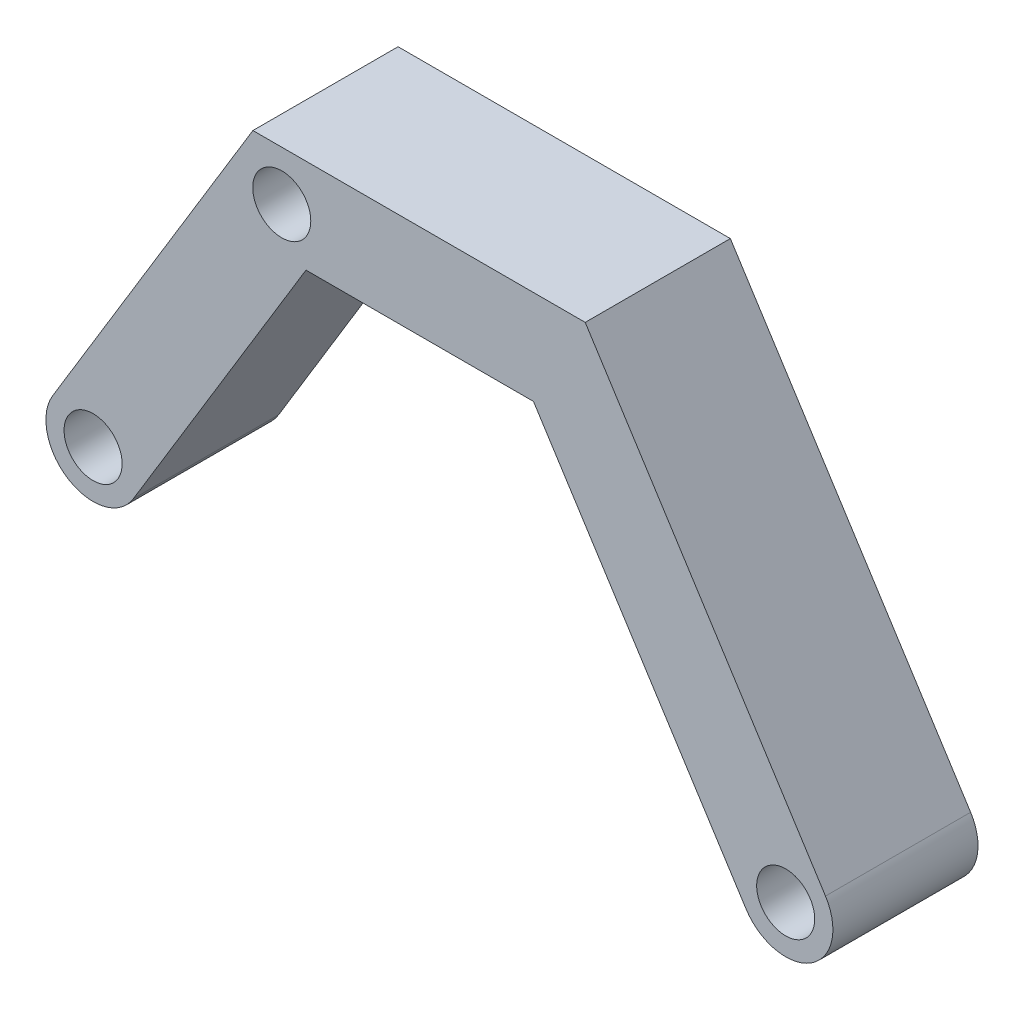
ISO-10303-21;
HEADER;
FILE_DESCRIPTION(('STEP AP214'),'2;1');
FILE_NAME('part.step','',(''),(''),'','','');
FILE_SCHEMA(('AUTOMOTIVE_DESIGN { 1 0 10303 214 1 1 1 1 }'));
ENDSEC;
DATA;
#1=APPLICATION_CONTEXT('core data for automotive mechanical design processes');
#2=APPLICATION_PROTOCOL_DEFINITION('international standard','automotive_design',2000,#1);
#3=PRODUCT_CONTEXT('',#1,'mechanical');
#4=PRODUCT('Part','Part','',(#3));
#5=PRODUCT_RELATED_PRODUCT_CATEGORY('part','',(#4));
#6=PRODUCT_DEFINITION_FORMATION('','',#4);
#7=PRODUCT_DEFINITION_CONTEXT('part definition',#1,'design');
#8=PRODUCT_DEFINITION('design','',#6,#7);
#9=PRODUCT_DEFINITION_SHAPE('','',#8);
#10=(LENGTH_UNIT() NAMED_UNIT(*) SI_UNIT(.MILLI.,.METRE.));
#11=(NAMED_UNIT(*) PLANE_ANGLE_UNIT() SI_UNIT($,.RADIAN.));
#12=(NAMED_UNIT(*) SI_UNIT($,.STERADIAN.) SOLID_ANGLE_UNIT());
#13=UNCERTAINTY_MEASURE_WITH_UNIT(LENGTH_MEASURE(1.E-05),#10,'distance_accuracy_value','');
#14=(GEOMETRIC_REPRESENTATION_CONTEXT(3) GLOBAL_UNCERTAINTY_ASSIGNED_CONTEXT((#13)) GLOBAL_UNIT_ASSIGNED_CONTEXT((#10,
#11,#12)) REPRESENTATION_CONTEXT('',''));
#15=CARTESIAN_POINT('',(0.,0.,0.));
#16=DIRECTION('',(0.,0.,1.));
#17=DIRECTION('',(1.,0.,0.));
#18=AXIS2_PLACEMENT_3D('',#15,#16,#17);
#19=CARTESIAN_POINT('',(14.4513309187229,-15.3639147043616,40.));
#20=DIRECTION('',(0.,0.,1.));
#21=DIRECTION('',(1.,0.,0.));
#22=AXIS2_PLACEMENT_3D('',#19,#20,#21);
#23=PLANE('',#22);
#24=CARTESIAN_POINT('',(66.4465332523392,68.5833959349722,40.));
#25=DIRECTION('',(0.,0.,1.));
#26=DIRECTION('',(1.,0.,0.));
#27=AXIS2_PLACEMENT_3D('',#24,#25,#26);
#28=CIRCLE('',#27,8.00000000000001);
#29=CARTESIAN_POINT('',(74.4465332523392,68.5833959349722,40.));
#30=VERTEX_POINT('',#29);
#31=EDGE_CURVE('E226',#30,#30,#28,.T.);
#32=ORIENTED_EDGE('',*,*,#31,.F.);
#33=EDGE_LOOP('',(#32));
#34=FACE_BOUND('',#33,.T.);
#35=CARTESIAN_POINT('',(14.4513309187229,-15.3639147043616,40.));
#36=DIRECTION('',(0.,0.,1.));
#37=DIRECTION('',(1.,0.,0.));
#38=AXIS2_PLACEMENT_3D('',#35,#36,#37);
#39=CIRCLE('',#38,8.);
#40=CARTESIAN_POINT('',(22.4513309187229,-15.3639147043616,40.));
#41=VERTEX_POINT('',#40);
#42=EDGE_CURVE('E147',#41,#41,#39,.T.);
#43=ORIENTED_EDGE('',*,*,#42,.F.);
#44=EDGE_LOOP('',(#43));
#45=FACE_BOUND('',#44,.T.);
#46=CARTESIAN_POINT('',(14.4513309187229,-15.3639147043616,40.));
#47=DIRECTION('',(0.,0.,1.));
#48=DIRECTION('',(1.,0.,0.));
#49=AXIS2_PLACEMENT_3D('',#46,#47,#48);
#50=CIRCLE('',#49,13.);
#51=CARTESIAN_POINT('',(3.33953923838088,-8.61646439682452,40.));
#52=VERTEX_POINT('',#51);
#53=CARTESIAN_POINT('',(25.5631225990649,-22.1113650118987,40.));
#54=VERTEX_POINT('',#53);
#55=EDGE_CURVE('E165',#52,#54,#50,.T.);
#56=ORIENTED_EDGE('',*,*,#55,.T.);
#57=DIRECTION('',(0.519034639041316,0.854753206180153,0.));
#58=VECTOR('',#57,1.);
#59=CARTESIAN_POINT('',(25.5631225990649,-22.1113650118987,40.));
#60=LINE('',#59,#58);
#61=CARTESIAN_POINT('',(73.1268271993905,56.2171817687676,40.));
#62=VERTEX_POINT('',#61);
#63=EDGE_CURVE('E101',#54,#62,#60,.T.);
#64=ORIENTED_EDGE('',*,*,#63,.T.);
#65=DIRECTION('',(1.,0.,0.));
#66=VECTOR('',#65,1.);
#67=CARTESIAN_POINT('',(73.1268271993905,56.2171817687676,40.));
#68=LINE('',#67,#66);
#69=CARTESIAN_POINT('',(135.819853477294,56.2171817687676,40.));
#70=VERTEX_POINT('',#69);
#71=EDGE_CURVE('E187',#62,#70,#68,.T.);
#72=ORIENTED_EDGE('',*,*,#71,.T.);
#73=DIRECTION('',(0.537781372943536,-0.843084334402535,0.));
#74=VECTOR('',#73,1.);
#75=CARTESIAN_POINT('',(135.819853477294,56.2171817687676,40.));
#76=LINE('',#75,#74);
#77=CARTESIAN_POINT('',(194.374158499835,-35.5788895717599,40.));
#78=VERTEX_POINT('',#77);
#79=EDGE_CURVE('E201',#70,#78,#76,.T.);
#80=ORIENTED_EDGE('',*,*,#79,.T.);
#81=CARTESIAN_POINT('',(205.334254847068,-28.587731723494,40.));
#82=DIRECTION('',(0.,0.,1.));
#83=DIRECTION('',(1.,0.,0.));
#84=AXIS2_PLACEMENT_3D('',#81,#82,#83);
#85=CIRCLE('',#84,13.);
#86=CARTESIAN_POINT('',(216.294351194301,-21.596573875228,40.));
#87=VERTEX_POINT('',#86);
#88=EDGE_CURVE('E120',#78,#87,#85,.T.);
#89=ORIENTED_EDGE('',*,*,#88,.T.);
#90=DIRECTION('',(-0.537781372943536,0.843084334402535,0.));
#91=VECTOR('',#90,1.);
#92=CARTESIAN_POINT('',(150.074280719125,82.2171817687676,40.));
#93=LINE('',#92,#91);
#94=CARTESIAN_POINT('',(150.074280719125,82.2171817687676,40.));
#95=VERTEX_POINT('',#94);
#96=EDGE_CURVE('E114',#87,#95,#93,.T.);
#97=ORIENTED_EDGE('',*,*,#96,.T.);
#98=DIRECTION('',(-1.,0.,0.));
#99=VECTOR('',#98,1.);
#100=CARTESIAN_POINT('',(58.4967570288316,82.2171817687676,40.));
#101=LINE('',#100,#99);
#102=CARTESIAN_POINT('',(58.4967570288316,82.2171817687676,40.));
#103=VERTEX_POINT('',#102);
#104=EDGE_CURVE('E118',#95,#103,#101,.T.);
#105=ORIENTED_EDGE('',*,*,#104,.T.);
#106=DIRECTION('',(-0.519034639041316,-0.854753206180153,0.));
#107=VECTOR('',#106,1.);
#108=CARTESIAN_POINT('',(3.33953923838088,-8.61646439682452,40.));
#109=LINE('',#108,#107);
#110=EDGE_CURVE('E58',#103,#52,#109,.T.);
#111=ORIENTED_EDGE('',*,*,#110,.T.);
#112=EDGE_LOOP('',(#56,#64,#72,#80,#89,#97,#105,#111));
#113=FACE_BOUND('',#112,.T.);
#114=CARTESIAN_POINT('',(205.334254847068,-28.587731723494,40.));
#115=DIRECTION('',(0.,0.,1.));
#116=DIRECTION('',(1.,0.,0.));
#117=AXIS2_PLACEMENT_3D('',#114,#115,#116);
#118=CIRCLE('',#117,8.00000000000001);
#119=CARTESIAN_POINT('',(213.334254847068,-28.587731723494,40.));
#120=VERTEX_POINT('',#119);
#121=EDGE_CURVE('E215',#120,#120,#118,.T.);
#122=ORIENTED_EDGE('',*,*,#121,.F.);
#123=EDGE_LOOP('',(#122));
#124=FACE_BOUND('',#123,.T.);
#125=ADVANCED_FACE('F39',(#34,#45,#113,#124),#23,.T.);
#126=CARTESIAN_POINT('',(14.4513309187229,-15.3639147043616,0.));
#127=DIRECTION('',(0.,0.,1.));
#128=DIRECTION('',(1.,0.,0.));
#129=AXIS2_PLACEMENT_3D('',#126,#127,#128);
#130=PLANE('',#129);
#131=CARTESIAN_POINT('',(66.4465332523392,68.5833959349722,0.));
#132=DIRECTION('',(0.,0.,1.));
#133=DIRECTION('',(1.,0.,0.));
#134=AXIS2_PLACEMENT_3D('',#131,#132,#133);
#135=CIRCLE('',#134,8.00000000000001);
#136=CARTESIAN_POINT('',(74.4465332523392,68.5833959349722,0.));
#137=VERTEX_POINT('',#136);
#138=EDGE_CURVE('E43',#137,#137,#135,.T.);
#139=ORIENTED_EDGE('',*,*,#138,.T.);
#140=EDGE_LOOP('',(#139));
#141=FACE_BOUND('',#140,.T.);
#142=CARTESIAN_POINT('',(14.4513309187229,-15.3639147043616,0.));
#143=DIRECTION('',(0.,0.,1.));
#144=DIRECTION('',(1.,0.,0.));
#145=AXIS2_PLACEMENT_3D('',#142,#143,#144);
#146=CIRCLE('',#145,13.);
#147=CARTESIAN_POINT('',(3.33953923838088,-8.61646439682452,0.));
#148=VERTEX_POINT('',#147);
#149=CARTESIAN_POINT('',(25.5631225990649,-22.1113650118987,0.));
#150=VERTEX_POINT('',#149);
#151=EDGE_CURVE('E142',#148,#150,#146,.T.);
#152=ORIENTED_EDGE('',*,*,#151,.F.);
#153=DIRECTION('',(-0.519034639041316,-0.854753206180153,0.));
#154=VECTOR('',#153,1.);
#155=CARTESIAN_POINT('',(3.33953923838088,-8.61646439682452,0.));
#156=LINE('',#155,#154);
#157=CARTESIAN_POINT('',(58.4967570288316,82.2171817687676,0.));
#158=VERTEX_POINT('',#157);
#159=EDGE_CURVE('E93',#158,#148,#156,.T.);
#160=ORIENTED_EDGE('',*,*,#159,.F.);
#161=DIRECTION('',(-1.,0.,0.));
#162=VECTOR('',#161,1.);
#163=CARTESIAN_POINT('',(58.4967570288316,82.2171817687676,0.));
#164=LINE('',#163,#162);
#165=CARTESIAN_POINT('',(150.074280719125,82.2171817687676,0.));
#166=VERTEX_POINT('',#165);
#167=EDGE_CURVE('E87',#166,#158,#164,.T.);
#168=ORIENTED_EDGE('',*,*,#167,.F.);
#169=DIRECTION('',(-0.537781372943536,0.843084334402535,0.));
#170=VECTOR('',#169,1.);
#171=CARTESIAN_POINT('',(150.074280719125,82.2171817687676,0.));
#172=LINE('',#171,#170);
#173=CARTESIAN_POINT('',(216.294351194301,-21.596573875228,0.));
#174=VERTEX_POINT('',#173);
#175=EDGE_CURVE('E129',#174,#166,#172,.T.);
#176=ORIENTED_EDGE('',*,*,#175,.F.);
#177=CARTESIAN_POINT('',(205.334254847068,-28.587731723494,0.));
#178=DIRECTION('',(0.,0.,1.));
#179=DIRECTION('',(1.,0.,0.));
#180=AXIS2_PLACEMENT_3D('',#177,#178,#179);
#181=CIRCLE('',#180,13.);
#182=CARTESIAN_POINT('',(194.374158499835,-35.5788895717599,0.));
#183=VERTEX_POINT('',#182);
#184=EDGE_CURVE('E156',#183,#174,#181,.T.);
#185=ORIENTED_EDGE('',*,*,#184,.F.);
#186=DIRECTION('',(0.537781372943536,-0.843084334402535,0.));
#187=VECTOR('',#186,1.);
#188=CARTESIAN_POINT('',(135.819853477294,56.2171817687676,0.));
#189=LINE('',#188,#187);
#190=CARTESIAN_POINT('',(135.819853477294,56.2171817687676,0.));
#191=VERTEX_POINT('',#190);
#192=EDGE_CURVE('E153',#191,#183,#189,.T.);
#193=ORIENTED_EDGE('',*,*,#192,.F.);
#194=DIRECTION('',(1.,0.,0.));
#195=VECTOR('',#194,1.);
#196=CARTESIAN_POINT('',(73.1268271993905,56.2171817687676,0.));
#197=LINE('',#196,#195);
#198=CARTESIAN_POINT('',(73.1268271993905,56.2171817687676,0.));
#199=VERTEX_POINT('',#198);
#200=EDGE_CURVE('E150',#199,#191,#197,.T.);
#201=ORIENTED_EDGE('',*,*,#200,.F.);
#202=DIRECTION('',(0.519034639041316,0.854753206180153,0.));
#203=VECTOR('',#202,1.);
#204=CARTESIAN_POINT('',(25.5631225990649,-22.1113650118987,0.));
#205=LINE('',#204,#203);
#206=EDGE_CURVE('E146',#150,#199,#205,.T.);
#207=ORIENTED_EDGE('',*,*,#206,.F.);
#208=EDGE_LOOP('',(#152,#160,#168,#176,#185,#193,#201,#207));
#209=FACE_BOUND('',#208,.T.);
#210=CARTESIAN_POINT('',(14.4513309187229,-15.3639147043616,0.));
#211=DIRECTION('',(0.,0.,1.));
#212=DIRECTION('',(1.,0.,0.));
#213=AXIS2_PLACEMENT_3D('',#210,#211,#212);
#214=CIRCLE('',#213,8.);
#215=CARTESIAN_POINT('',(22.4513309187229,-15.3639147043616,0.));
#216=VERTEX_POINT('',#215);
#217=EDGE_CURVE('E211',#216,#216,#214,.T.);
#218=ORIENTED_EDGE('',*,*,#217,.T.);
#219=EDGE_LOOP('',(#218));
#220=FACE_BOUND('',#219,.T.);
#221=CARTESIAN_POINT('',(205.334254847068,-28.587731723494,0.));
#222=DIRECTION('',(0.,0.,1.));
#223=DIRECTION('',(1.,0.,0.));
#224=AXIS2_PLACEMENT_3D('',#221,#222,#223);
#225=CIRCLE('',#224,8.00000000000001);
#226=CARTESIAN_POINT('',(213.334254847068,-28.587731723494,0.));
#227=VERTEX_POINT('',#226);
#228=EDGE_CURVE('E219',#227,#227,#225,.T.);
#229=ORIENTED_EDGE('',*,*,#228,.T.);
#230=EDGE_LOOP('',(#229));
#231=FACE_BOUND('',#230,.T.);
#232=ADVANCED_FACE('F191',(#141,#209,#220,#231),#130,.F.);
#233=CARTESIAN_POINT('',(14.4513309187229,-15.3639147043616,40.));
#234=DIRECTION('',(0.,0.,-1.));
#235=DIRECTION('',(-1.,0.,0.));
#236=AXIS2_PLACEMENT_3D('',#233,#234,#235);
#237=CYLINDRICAL_SURFACE('',#236,13.);
#238=ORIENTED_EDGE('',*,*,#151,.T.);
#239=DIRECTION('',(0.,0.,-1.));
#240=VECTOR('',#239,1.);
#241=CARTESIAN_POINT('',(25.5631225990649,-22.1113650118987,40.));
#242=LINE('',#241,#240);
#243=EDGE_CURVE('E11',#54,#150,#242,.T.);
#244=ORIENTED_EDGE('',*,*,#243,.F.);
#245=ORIENTED_EDGE('',*,*,#55,.F.);
#246=DIRECTION('',(0.,0.,-1.));
#247=VECTOR('',#246,1.);
#248=CARTESIAN_POINT('',(3.33953923838088,-8.61646439682452,40.));
#249=LINE('',#248,#247);
#250=EDGE_CURVE('E138',#52,#148,#249,.T.);
#251=ORIENTED_EDGE('',*,*,#250,.T.);
#252=EDGE_LOOP('',(#238,#244,#245,#251));
#253=FACE_BOUND('',#252,.T.);
#254=ADVANCED_FACE('F41',(#253),#237,.T.);
#255=CARTESIAN_POINT('',(25.5631225990649,-22.1113650118987,40.));
#256=DIRECTION('',(-0.854753206180153,0.519034639041316,0.));
#257=DIRECTION('',(-0.519034639041316,-0.854753206180153,0.));
#258=AXIS2_PLACEMENT_3D('',#255,#256,#257);
#259=PLANE('',#258);
#260=ORIENTED_EDGE('',*,*,#206,.T.);
#261=DIRECTION('',(0.,0.,-1.));
#262=VECTOR('',#261,1.);
#263=CARTESIAN_POINT('',(73.1268271993905,56.2171817687676,40.));
#264=LINE('',#263,#262);
#265=EDGE_CURVE('E50',#62,#199,#264,.T.);
#266=ORIENTED_EDGE('',*,*,#265,.F.);
#267=ORIENTED_EDGE('',*,*,#63,.F.);
#268=ORIENTED_EDGE('',*,*,#243,.T.);
#269=EDGE_LOOP('',(#260,#266,#267,#268));
#270=FACE_BOUND('',#269,.T.);
#271=ADVANCED_FACE('F268',(#270),#259,.F.);
#272=CARTESIAN_POINT('',(73.1268271993905,56.2171817687676,40.));
#273=DIRECTION('',(0.,1.,0.));
#274=DIRECTION('',(0.,0.,1.));
#275=AXIS2_PLACEMENT_3D('',#272,#273,#274);
#276=PLANE('',#275);
#277=ORIENTED_EDGE('',*,*,#200,.T.);
#278=DIRECTION('',(0.,0.,-1.));
#279=VECTOR('',#278,1.);
#280=CARTESIAN_POINT('',(135.819853477294,56.2171817687676,40.));
#281=LINE('',#280,#279);
#282=EDGE_CURVE('E176',#70,#191,#281,.T.);
#283=ORIENTED_EDGE('',*,*,#282,.F.);
#284=ORIENTED_EDGE('',*,*,#71,.F.);
#285=ORIENTED_EDGE('',*,*,#265,.T.);
#286=EDGE_LOOP('',(#277,#283,#284,#285));
#287=FACE_BOUND('',#286,.T.);
#288=ADVANCED_FACE('F185',(#287),#276,.F.);
#289=CARTESIAN_POINT('',(135.819853477294,56.2171817687676,40.));
#290=DIRECTION('',(0.843084334402535,0.537781372943536,0.));
#291=DIRECTION('',(-0.537781372943536,0.843084334402535,0.));
#292=AXIS2_PLACEMENT_3D('',#289,#290,#291);
#293=PLANE('',#292);
#294=ORIENTED_EDGE('',*,*,#192,.T.);
#295=DIRECTION('',(0.,0.,-1.));
#296=VECTOR('',#295,1.);
#297=CARTESIAN_POINT('',(194.374158499835,-35.5788895717599,40.));
#298=LINE('',#297,#296);
#299=EDGE_CURVE('E172',#78,#183,#298,.T.);
#300=ORIENTED_EDGE('',*,*,#299,.F.);
#301=ORIENTED_EDGE('',*,*,#79,.F.);
#302=ORIENTED_EDGE('',*,*,#282,.T.);
#303=EDGE_LOOP('',(#294,#300,#301,#302));
#304=FACE_BOUND('',#303,.T.);
#305=ADVANCED_FACE('F196',(#304),#293,.F.);
#306=CARTESIAN_POINT('',(205.334254847068,-28.587731723494,40.));
#307=DIRECTION('',(0.,0.,-1.));
#308=DIRECTION('',(-1.,0.,0.));
#309=AXIS2_PLACEMENT_3D('',#306,#307,#308);
#310=CYLINDRICAL_SURFACE('',#309,13.);
#311=ORIENTED_EDGE('',*,*,#184,.T.);
#312=DIRECTION('',(0.,0.,-1.));
#313=VECTOR('',#312,1.);
#314=CARTESIAN_POINT('',(216.294351194301,-21.596573875228,40.));
#315=LINE('',#314,#313);
#316=EDGE_CURVE('E131',#87,#174,#315,.T.);
#317=ORIENTED_EDGE('',*,*,#316,.F.);
#318=ORIENTED_EDGE('',*,*,#88,.F.);
#319=ORIENTED_EDGE('',*,*,#299,.T.);
#320=EDGE_LOOP('',(#311,#317,#318,#319));
#321=FACE_BOUND('',#320,.T.);
#322=ADVANCED_FACE('F199',(#321),#310,.T.);
#323=CARTESIAN_POINT('',(150.074280719125,82.2171817687676,40.));
#324=DIRECTION('',(-0.843084334402535,-0.537781372943536,0.));
#325=DIRECTION('',(0.537781372943536,-0.843084334402535,0.));
#326=AXIS2_PLACEMENT_3D('',#323,#324,#325);
#327=PLANE('',#326);
#328=ORIENTED_EDGE('',*,*,#175,.T.);
#329=DIRECTION('',(0.,0.,-1.));
#330=VECTOR('',#329,1.);
#331=CARTESIAN_POINT('',(150.074280719125,82.2171817687676,40.));
#332=LINE('',#331,#330);
#333=EDGE_CURVE('E126',#95,#166,#332,.T.);
#334=ORIENTED_EDGE('',*,*,#333,.F.);
#335=ORIENTED_EDGE('',*,*,#96,.F.);
#336=ORIENTED_EDGE('',*,*,#316,.T.);
#337=EDGE_LOOP('',(#328,#334,#335,#336));
#338=FACE_BOUND('',#337,.T.);
#339=ADVANCED_FACE('F127',(#338),#327,.F.);
#340=CARTESIAN_POINT('',(58.4967570288316,82.2171817687676,40.));
#341=DIRECTION('',(0.,-1.,0.));
#342=DIRECTION('',(0.,0.,-1.));
#343=AXIS2_PLACEMENT_3D('',#340,#341,#342);
#344=PLANE('',#343);
#345=ORIENTED_EDGE('',*,*,#167,.T.);
#346=DIRECTION('',(0.,0.,-1.));
#347=VECTOR('',#346,1.);
#348=CARTESIAN_POINT('',(58.4967570288316,82.2171817687676,40.));
#349=LINE('',#348,#347);
#350=EDGE_CURVE('E132',#103,#158,#349,.T.);
#351=ORIENTED_EDGE('',*,*,#350,.F.);
#352=ORIENTED_EDGE('',*,*,#104,.F.);
#353=ORIENTED_EDGE('',*,*,#333,.T.);
#354=EDGE_LOOP('',(#345,#351,#352,#353));
#355=FACE_BOUND('',#354,.T.);
#356=ADVANCED_FACE('F134',(#355),#344,.F.);
#357=CARTESIAN_POINT('',(3.33953923838088,-8.61646439682452,40.));
#358=DIRECTION('',(0.854753206180153,-0.519034639041316,0.));
#359=DIRECTION('',(0.519034639041316,0.854753206180153,0.));
#360=AXIS2_PLACEMENT_3D('',#357,#358,#359);
#361=PLANE('',#360);
#362=ORIENTED_EDGE('',*,*,#159,.T.);
#363=ORIENTED_EDGE('',*,*,#250,.F.);
#364=ORIENTED_EDGE('',*,*,#110,.F.);
#365=ORIENTED_EDGE('',*,*,#350,.T.);
#366=EDGE_LOOP('',(#362,#363,#364,#365));
#367=FACE_BOUND('',#366,.T.);
#368=ADVANCED_FACE('F256',(#367),#361,.F.);
#369=CARTESIAN_POINT('',(14.4513309187229,-15.3639147043616,40.));
#370=DIRECTION('',(0.,0.,-1.));
#371=DIRECTION('',(-1.,0.,0.));
#372=AXIS2_PLACEMENT_3D('',#369,#370,#371);
#373=CYLINDRICAL_SURFACE('',#372,8.);
#374=ORIENTED_EDGE('',*,*,#42,.T.);
#375=EDGE_LOOP('',(#374));
#376=FACE_BOUND('',#375,.T.);
#377=ORIENTED_EDGE('',*,*,#217,.F.);
#378=EDGE_LOOP('',(#377));
#379=FACE_BOUND('',#378,.T.);
#380=ADVANCED_FACE('F243',(#376,#379),#373,.F.);
#381=CARTESIAN_POINT('',(205.334254847068,-28.587731723494,40.));
#382=DIRECTION('',(0.,0.,-1.));
#383=DIRECTION('',(-1.,0.,0.));
#384=AXIS2_PLACEMENT_3D('',#381,#382,#383);
#385=CYLINDRICAL_SURFACE('',#384,8.00000000000001);
#386=ORIENTED_EDGE('',*,*,#121,.T.);
#387=EDGE_LOOP('',(#386));
#388=FACE_BOUND('',#387,.T.);
#389=ORIENTED_EDGE('',*,*,#228,.F.);
#390=EDGE_LOOP('',(#389));
#391=FACE_BOUND('',#390,.T.);
#392=ADVANCED_FACE('F238',(#388,#391),#385,.F.);
#393=CARTESIAN_POINT('',(66.4465332523392,68.5833959349722,-160.));
#394=DIRECTION('',(0.,0.,1.));
#395=DIRECTION('',(1.,0.,0.));
#396=AXIS2_PLACEMENT_3D('',#393,#394,#395);
#397=CYLINDRICAL_SURFACE('',#396,8.00000000000001);
#398=ORIENTED_EDGE('',*,*,#31,.T.);
#399=EDGE_LOOP('',(#398));
#400=FACE_BOUND('',#399,.T.);
#401=ORIENTED_EDGE('',*,*,#138,.F.);
#402=EDGE_LOOP('',(#401));
#403=FACE_BOUND('',#402,.T.);
#404=ADVANCED_FACE('F236',(#400,#403),#397,.F.);
#405=CLOSED_SHELL('',(#125,#232,#254,#271,#288,#305,#322,#339,#356,#368,#380,#392,#404));
#406=MANIFOLD_SOLID_BREP('B2',#405);
#407=ADVANCED_BREP_SHAPE_REPRESENTATION('',(#18,#406),#14);
#408=SHAPE_DEFINITION_REPRESENTATION(#9,#407);
ENDSEC;
END-ISO-10303-21;
